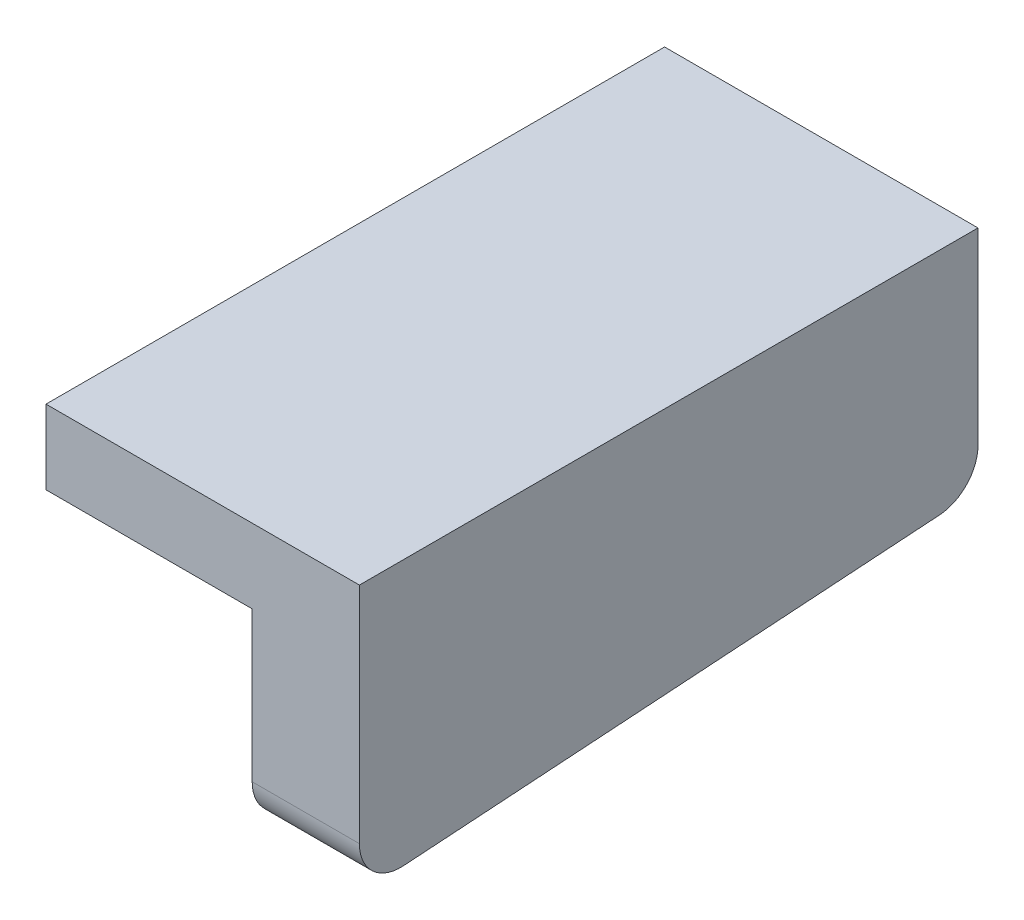
ISO-10303-21;
HEADER;
FILE_DESCRIPTION(('STEP AP214'),'2;1');
FILE_NAME('part.step','',(''),(''),'','','');
FILE_SCHEMA(('AUTOMOTIVE_DESIGN { 1 0 10303 214 1 1 1 1 }'));
ENDSEC;
DATA;
#1=APPLICATION_CONTEXT('core data for automotive mechanical design processes');
#2=APPLICATION_PROTOCOL_DEFINITION('international standard','automotive_design',2000,#1);
#3=PRODUCT_CONTEXT('',#1,'mechanical');
#4=PRODUCT('Part','Part','',(#3));
#5=PRODUCT_RELATED_PRODUCT_CATEGORY('part','',(#4));
#6=PRODUCT_DEFINITION_FORMATION('','',#4);
#7=PRODUCT_DEFINITION_CONTEXT('part definition',#1,'design');
#8=PRODUCT_DEFINITION('design','',#6,#7);
#9=PRODUCT_DEFINITION_SHAPE('','',#8);
#10=(LENGTH_UNIT() NAMED_UNIT(*) SI_UNIT(.MILLI.,.METRE.));
#11=(NAMED_UNIT(*) PLANE_ANGLE_UNIT() SI_UNIT($,.RADIAN.));
#12=(NAMED_UNIT(*) SI_UNIT($,.STERADIAN.) SOLID_ANGLE_UNIT());
#13=UNCERTAINTY_MEASURE_WITH_UNIT(LENGTH_MEASURE(1.E-05),#10,'distance_accuracy_value','');
#14=(GEOMETRIC_REPRESENTATION_CONTEXT(3) GLOBAL_UNCERTAINTY_ASSIGNED_CONTEXT((#13)) GLOBAL_UNIT_ASSIGNED_CONTEXT((#10,
#11,#12)) REPRESENTATION_CONTEXT('',''));
#15=CARTESIAN_POINT('',(0.,0.,0.));
#16=DIRECTION('',(0.,0.,1.));
#17=DIRECTION('',(1.,0.,0.));
#18=AXIS2_PLACEMENT_3D('',#15,#16,#17);
#19=CARTESIAN_POINT('',(-6.3,15.8,15.));
#20=DIRECTION('',(1.,0.,0.));
#21=DIRECTION('',(0.,0.,-1.));
#22=AXIS2_PLACEMENT_3D('',#19,#20,#21);
#23=PLANE('',#22);
#24=DIRECTION('',(0.,-1.,0.));
#25=VECTOR('',#24,1.);
#26=CARTESIAN_POINT('',(-6.3,15.8,0.));
#27=LINE('',#26,#25);
#28=CARTESIAN_POINT('',(-6.3,15.8,0.));
#29=VERTEX_POINT('',#28);
#30=CARTESIAN_POINT('',(-6.3,14.,0.));
#31=VERTEX_POINT('',#30);
#32=EDGE_CURVE('E123',#29,#31,#27,.T.);
#33=ORIENTED_EDGE('',*,*,#32,.T.);
#34=DIRECTION('',(0.,0.,-1.));
#35=VECTOR('',#34,1.);
#36=CARTESIAN_POINT('',(-6.3,14.,15.));
#37=LINE('',#36,#35);
#38=CARTESIAN_POINT('',(-6.3,14.,15.));
#39=VERTEX_POINT('',#38);
#40=EDGE_CURVE('E103',#39,#31,#37,.T.);
#41=ORIENTED_EDGE('',*,*,#40,.F.);
#42=DIRECTION('',(0.,-1.,0.));
#43=VECTOR('',#42,1.);
#44=CARTESIAN_POINT('',(-6.3,15.8,15.));
#45=LINE('',#44,#43);
#46=CARTESIAN_POINT('',(-6.3,15.8,15.));
#47=VERTEX_POINT('',#46);
#48=EDGE_CURVE('E111',#47,#39,#45,.T.);
#49=ORIENTED_EDGE('',*,*,#48,.F.);
#50=DIRECTION('',(0.,0.,-1.));
#51=VECTOR('',#50,1.);
#52=CARTESIAN_POINT('',(-6.3,15.8,15.));
#53=LINE('',#52,#51);
#54=EDGE_CURVE('E174',#47,#29,#53,.T.);
#55=ORIENTED_EDGE('',*,*,#54,.T.);
#56=EDGE_LOOP('',(#33,#41,#49,#55));
#57=FACE_BOUND('',#56,.T.);
#58=ADVANCED_FACE('F34',(#57),#23,.F.);
#59=CARTESIAN_POINT('',(-6.3,14.,15.));
#60=DIRECTION('',(0.,1.,0.));
#61=DIRECTION('',(0.,0.,1.));
#62=AXIS2_PLACEMENT_3D('',#59,#60,#61);
#63=PLANE('',#62);
#64=DIRECTION('',(1.,0.,0.));
#65=VECTOR('',#64,1.);
#66=CARTESIAN_POINT('',(-6.3,14.,0.));
#67=LINE('',#66,#65);
#68=CARTESIAN_POINT('',(-1.3,14.,0.));
#69=VERTEX_POINT('',#68);
#70=EDGE_CURVE('E167',#31,#69,#67,.T.);
#71=ORIENTED_EDGE('',*,*,#70,.T.);
#72=DIRECTION('',(0.,0.,-1.));
#73=VECTOR('',#72,1.);
#74=CARTESIAN_POINT('',(-1.3,14.,15.));
#75=LINE('',#74,#73);
#76=CARTESIAN_POINT('',(-1.3,14.,15.));
#77=VERTEX_POINT('',#76);
#78=EDGE_CURVE('E106',#77,#69,#75,.T.);
#79=ORIENTED_EDGE('',*,*,#78,.F.);
#80=DIRECTION('',(1.,0.,0.));
#81=VECTOR('',#80,1.);
#82=CARTESIAN_POINT('',(-6.3,14.,15.));
#83=LINE('',#82,#81);
#84=EDGE_CURVE('E99',#39,#77,#83,.T.);
#85=ORIENTED_EDGE('',*,*,#84,.F.);
#86=ORIENTED_EDGE('',*,*,#40,.T.);
#87=EDGE_LOOP('',(#71,#79,#85,#86));
#88=FACE_BOUND('',#87,.T.);
#89=ADVANCED_FACE('F101',(#88),#63,.F.);
#90=CARTESIAN_POINT('',(-1.3,8.2,15.));
#91=DIRECTION('',(1.,0.,0.));
#92=DIRECTION('',(0.,1.,0.));
#93=AXIS2_PLACEMENT_3D('',#90,#91,#92);
#94=PLANE('',#93);
#95=DIRECTION('',(0.,-1.,0.));
#96=VECTOR('',#95,1.);
#97=CARTESIAN_POINT('',(-1.3,8.2,0.));
#98=LINE('',#97,#96);
#99=CARTESIAN_POINT('',(-1.3,11.2355530918915,0.));
#100=VERTEX_POINT('',#99);
#101=EDGE_CURVE('E155',#69,#100,#98,.T.);
#102=ORIENTED_EDGE('',*,*,#101,.T.);
#103=CARTESIAN_POINT('',(-1.3,11.2355530918915,1.));
#104=DIRECTION('',(1.,0.,0.));
#105=DIRECTION('',(0.,1.,0.));
#106=AXIS2_PLACEMENT_3D('',#103,#104,#105);
#107=CIRCLE('',#106,1.);
#108=CARTESIAN_POINT('',(-1.3,10.2377679340349,0.933480989476222));
#109=VERTEX_POINT('',#108);
#110=EDGE_CURVE('E134',#100,#109,#107,.F.);
#111=ORIENTED_EDGE('',*,*,#110,.T.);
#112=DIRECTION('',(0.,-0.066519010523774,0.997785157856609));
#113=VECTOR('',#112,1.);
#114=CARTESIAN_POINT('',(-1.3,9.29513274336284,15.0730088495575));
#115=LINE('',#114,#113);
#116=CARTESIAN_POINT('',(-1.3,9.37110126736825,13.9334809894762));
#117=VERTEX_POINT('',#116);
#118=EDGE_CURVE('E162',#109,#117,#115,.T.);
#119=ORIENTED_EDGE('',*,*,#118,.T.);
#120=CARTESIAN_POINT('',(-1.3,10.3688864252249,14.));
#121=DIRECTION('',(1.,0.,0.));
#122=DIRECTION('',(0.,1.,0.));
#123=AXIS2_PLACEMENT_3D('',#120,#121,#122);
#124=CIRCLE('',#123,1.);
#125=CARTESIAN_POINT('',(-1.3,10.3688864252249,15.));
#126=VERTEX_POINT('',#125);
#127=EDGE_CURVE('E127',#117,#126,#124,.F.);
#128=ORIENTED_EDGE('',*,*,#127,.T.);
#129=DIRECTION('',(0.,-1.,0.));
#130=VECTOR('',#129,1.);
#131=CARTESIAN_POINT('',(-1.3,8.2,15.));
#132=LINE('',#131,#130);
#133=EDGE_CURVE('E110',#77,#126,#132,.T.);
#134=ORIENTED_EDGE('',*,*,#133,.F.);
#135=ORIENTED_EDGE('',*,*,#78,.T.);
#136=EDGE_LOOP('',(#102,#111,#119,#128,#134,#135));
#137=FACE_BOUND('',#136,.T.);
#138=ADVANCED_FACE('F161',(#137),#94,.F.);
#139=CARTESIAN_POINT('',(1.3,15.8,15.));
#140=DIRECTION('',(-1.,0.,0.));
#141=DIRECTION('',(0.,0.,1.));
#142=AXIS2_PLACEMENT_3D('',#139,#140,#141);
#143=PLANE('',#142);
#144=DIRECTION('',(0.,-0.066519010523774,0.997785157856609));
#145=VECTOR('',#144,1.);
#146=CARTESIAN_POINT('',(1.3,9.3,15.));
#147=LINE('',#146,#145);
#148=CARTESIAN_POINT('',(1.3,10.2377679340349,0.933480989476227));
#149=VERTEX_POINT('',#148);
#150=CARTESIAN_POINT('',(1.3,9.37110126736825,13.9334809894762));
#151=VERTEX_POINT('',#150);
#152=EDGE_CURVE('E146',#149,#151,#147,.T.);
#153=ORIENTED_EDGE('',*,*,#152,.F.);
#154=CARTESIAN_POINT('',(1.3,11.2355530918915,1.));
#155=DIRECTION('',(-1.,0.,0.));
#156=DIRECTION('',(0.,0.,1.));
#157=AXIS2_PLACEMENT_3D('',#154,#155,#156);
#158=CIRCLE('',#157,1.);
#159=CARTESIAN_POINT('',(1.3,11.2355530918915,0.));
#160=VERTEX_POINT('',#159);
#161=EDGE_CURVE('E42',#149,#160,#158,.F.);
#162=ORIENTED_EDGE('',*,*,#161,.T.);
#163=DIRECTION('',(0.,1.,0.));
#164=VECTOR('',#163,1.);
#165=CARTESIAN_POINT('',(1.3,15.8,0.));
#166=LINE('',#165,#164);
#167=CARTESIAN_POINT('',(1.3,15.8,0.));
#168=VERTEX_POINT('',#167);
#169=EDGE_CURVE('E144',#160,#168,#166,.T.);
#170=ORIENTED_EDGE('',*,*,#169,.T.);
#171=DIRECTION('',(0.,0.,-1.));
#172=VECTOR('',#171,1.);
#173=CARTESIAN_POINT('',(1.3,15.8,15.));
#174=LINE('',#173,#172);
#175=CARTESIAN_POINT('',(1.3,15.8,15.));
#176=VERTEX_POINT('',#175);
#177=EDGE_CURVE('E129',#176,#168,#174,.T.);
#178=ORIENTED_EDGE('',*,*,#177,.F.);
#179=DIRECTION('',(0.,1.,0.));
#180=VECTOR('',#179,1.);
#181=CARTESIAN_POINT('',(1.3,8.2,15.));
#182=LINE('',#181,#180);
#183=CARTESIAN_POINT('',(1.3,10.3688864252249,15.));
#184=VERTEX_POINT('',#183);
#185=EDGE_CURVE('E172',#184,#176,#182,.T.);
#186=ORIENTED_EDGE('',*,*,#185,.F.);
#187=CARTESIAN_POINT('',(1.3,10.3688864252249,14.));
#188=DIRECTION('',(-1.,0.,0.));
#189=DIRECTION('',(0.,0.,1.));
#190=AXIS2_PLACEMENT_3D('',#187,#188,#189);
#191=CIRCLE('',#190,1.);
#192=EDGE_CURVE('E49',#184,#151,#191,.F.);
#193=ORIENTED_EDGE('',*,*,#192,.T.);
#194=EDGE_LOOP('',(#153,#162,#170,#178,#186,#193));
#195=FACE_BOUND('',#194,.T.);
#196=ADVANCED_FACE('F142',(#195),#143,.F.);
#197=CARTESIAN_POINT('',(-6.3,15.8,15.));
#198=DIRECTION('',(0.,-1.,0.));
#199=DIRECTION('',(0.,0.,-1.));
#200=AXIS2_PLACEMENT_3D('',#197,#198,#199);
#201=PLANE('',#200);
#202=DIRECTION('',(-1.,0.,0.));
#203=VECTOR('',#202,1.);
#204=CARTESIAN_POINT('',(-6.3,15.8,0.));
#205=LINE('',#204,#203);
#206=EDGE_CURVE('E120',#168,#29,#205,.T.);
#207=ORIENTED_EDGE('',*,*,#206,.T.);
#208=ORIENTED_EDGE('',*,*,#54,.F.);
#209=DIRECTION('',(-1.,0.,0.));
#210=VECTOR('',#209,1.);
#211=CARTESIAN_POINT('',(-6.3,15.8,15.));
#212=LINE('',#211,#210);
#213=EDGE_CURVE('E116',#176,#47,#212,.T.);
#214=ORIENTED_EDGE('',*,*,#213,.F.);
#215=ORIENTED_EDGE('',*,*,#177,.T.);
#216=EDGE_LOOP('',(#207,#208,#214,#215));
#217=FACE_BOUND('',#216,.T.);
#218=ADVANCED_FACE('F180',(#217),#201,.F.);
#219=CARTESIAN_POINT('',(0.,0.,15.));
#220=DIRECTION('',(0.,0.,1.));
#221=DIRECTION('',(1.,0.,0.));
#222=AXIS2_PLACEMENT_3D('',#219,#220,#221);
#223=PLANE('',#222);
#224=ORIENTED_EDGE('',*,*,#133,.T.);
#225=DIRECTION('',(1.,0.,0.));
#226=VECTOR('',#225,1.);
#227=CARTESIAN_POINT('',(1.3,10.3688864252249,15.));
#228=LINE('',#227,#226);
#229=EDGE_CURVE('E11',#126,#184,#228,.T.);
#230=ORIENTED_EDGE('',*,*,#229,.T.);
#231=ORIENTED_EDGE('',*,*,#185,.T.);
#232=ORIENTED_EDGE('',*,*,#213,.T.);
#233=ORIENTED_EDGE('',*,*,#48,.T.);
#234=ORIENTED_EDGE('',*,*,#84,.T.);
#235=EDGE_LOOP('',(#224,#230,#231,#232,#233,#234));
#236=FACE_BOUND('',#235,.T.);
#237=ADVANCED_FACE('F114',(#236),#223,.T.);
#238=CARTESIAN_POINT('',(0.,0.,0.));
#239=DIRECTION('',(0.,0.,1.));
#240=DIRECTION('',(1.,0.,0.));
#241=AXIS2_PLACEMENT_3D('',#238,#239,#240);
#242=PLANE('',#241);
#243=ORIENTED_EDGE('',*,*,#169,.F.);
#244=DIRECTION('',(-1.,0.,0.));
#245=VECTOR('',#244,1.);
#246=CARTESIAN_POINT('',(0.,11.2355530918915,0.));
#247=LINE('',#246,#245);
#248=EDGE_CURVE('E124',#160,#100,#247,.T.);
#249=ORIENTED_EDGE('',*,*,#248,.T.);
#250=ORIENTED_EDGE('',*,*,#101,.F.);
#251=ORIENTED_EDGE('',*,*,#70,.F.);
#252=ORIENTED_EDGE('',*,*,#32,.F.);
#253=ORIENTED_EDGE('',*,*,#206,.F.);
#254=EDGE_LOOP('',(#243,#249,#250,#251,#252,#253));
#255=FACE_BOUND('',#254,.T.);
#256=ADVANCED_FACE('F152',(#255),#242,.F.);
#257=CARTESIAN_POINT('',(-13.7,9.3,15.));
#258=DIRECTION('',(0.,0.997785157856609,0.066519010523774));
#259=DIRECTION('',(0.,-0.066519010523774,0.997785157856609));
#260=AXIS2_PLACEMENT_3D('',#257,#258,#259);
#261=PLANE('',#260);
#262=ORIENTED_EDGE('',*,*,#118,.F.);
#263=DIRECTION('',(-1.,0.,0.));
#264=VECTOR('',#263,1.);
#265=CARTESIAN_POINT('',(-13.7,10.2377679340349,0.933480989476225));
#266=LINE('',#265,#264);
#267=EDGE_CURVE('E138',#109,#149,#266,.F.);
#268=ORIENTED_EDGE('',*,*,#267,.T.);
#269=ORIENTED_EDGE('',*,*,#152,.T.);
#270=DIRECTION('',(1.,0.,0.));
#271=VECTOR('',#270,1.);
#272=CARTESIAN_POINT('',(-1.3,9.37110126736825,13.9334809894762));
#273=LINE('',#272,#271);
#274=EDGE_CURVE('E136',#151,#117,#273,.F.);
#275=ORIENTED_EDGE('',*,*,#274,.T.);
#276=EDGE_LOOP('',(#262,#268,#269,#275));
#277=FACE_BOUND('',#276,.T.);
#278=ADVANCED_FACE('F165',(#277),#261,.F.);
#279=CARTESIAN_POINT('',(0.,11.2355530918915,1.));
#280=DIRECTION('',(-1.,0.,0.));
#281=DIRECTION('',(0.,0.,1.));
#282=AXIS2_PLACEMENT_3D('',#279,#280,#281);
#283=CYLINDRICAL_SURFACE('',#282,1.);
#284=ORIENTED_EDGE('',*,*,#161,.F.);
#285=ORIENTED_EDGE('',*,*,#267,.F.);
#286=ORIENTED_EDGE('',*,*,#110,.F.);
#287=ORIENTED_EDGE('',*,*,#248,.F.);
#288=EDGE_LOOP('',(#284,#285,#286,#287));
#289=FACE_BOUND('',#288,.T.);
#290=ADVANCED_FACE('F157',(#289),#283,.T.);
#291=CARTESIAN_POINT('',(0.,10.3688864252249,14.));
#292=DIRECTION('',(-1.,0.,0.));
#293=DIRECTION('',(0.,0.,1.));
#294=AXIS2_PLACEMENT_3D('',#291,#292,#293);
#295=CYLINDRICAL_SURFACE('',#294,1.);
#296=ORIENTED_EDGE('',*,*,#127,.F.);
#297=ORIENTED_EDGE('',*,*,#274,.F.);
#298=ORIENTED_EDGE('',*,*,#192,.F.);
#299=ORIENTED_EDGE('',*,*,#229,.F.);
#300=EDGE_LOOP('',(#296,#297,#298,#299));
#301=FACE_BOUND('',#300,.T.);
#302=ADVANCED_FACE('F36',(#301),#295,.T.);
#303=CLOSED_SHELL('',(#58,#89,#138,#196,#218,#237,#256,#278,#290,#302));
#304=MANIFOLD_SOLID_BREP('B2',#303);
#305=ADVANCED_BREP_SHAPE_REPRESENTATION('',(#18,#304),#14);
#306=SHAPE_DEFINITION_REPRESENTATION(#9,#305);
ENDSEC;
END-ISO-10303-21;
